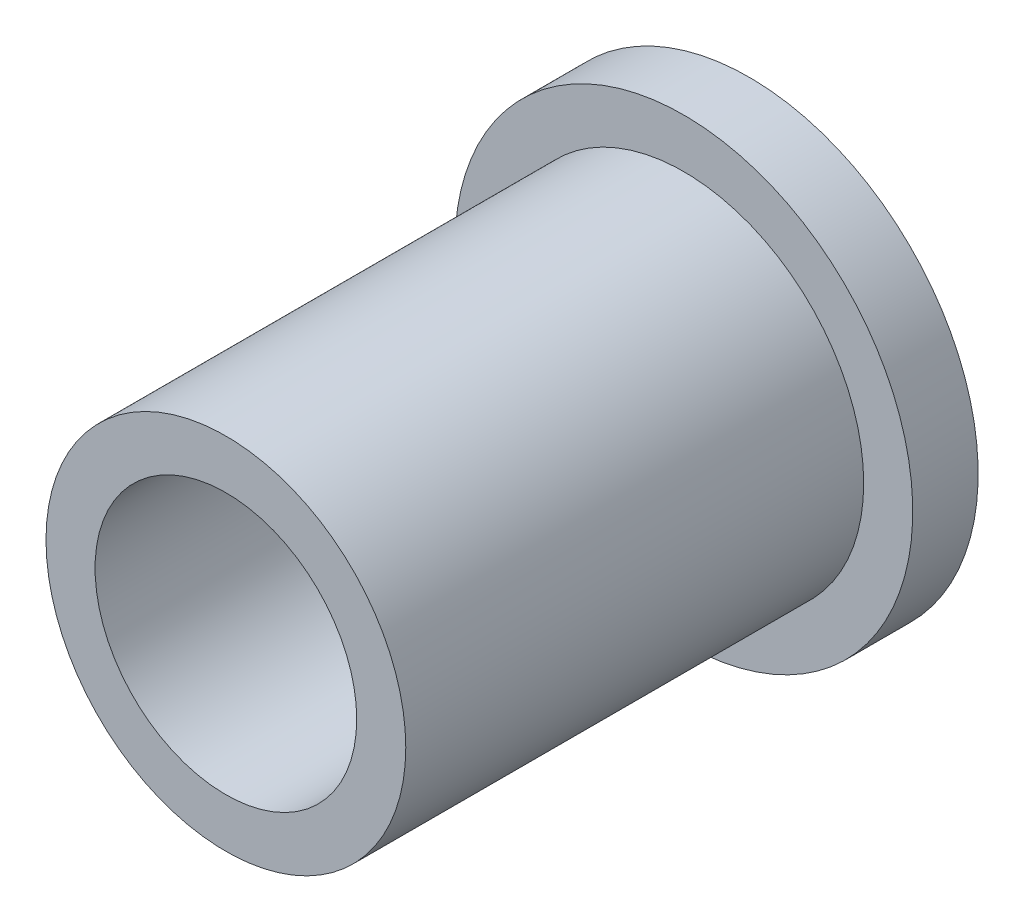
ISO-10303-21;
HEADER;
FILE_DESCRIPTION(('STEP AP214'),'2;1');
FILE_NAME('part.step','',(''),(''),'','','');
FILE_SCHEMA(('AUTOMOTIVE_DESIGN { 1 0 10303 214 1 1 1 1 }'));
ENDSEC;
DATA;
#1=APPLICATION_CONTEXT('core data for automotive mechanical design processes');
#2=APPLICATION_PROTOCOL_DEFINITION('international standard','automotive_design',2000,#1);
#3=PRODUCT_CONTEXT('',#1,'mechanical');
#4=PRODUCT('Part','Part','',(#3));
#5=PRODUCT_RELATED_PRODUCT_CATEGORY('part','',(#4));
#6=PRODUCT_DEFINITION_FORMATION('','',#4);
#7=PRODUCT_DEFINITION_CONTEXT('part definition',#1,'design');
#8=PRODUCT_DEFINITION('design','',#6,#7);
#9=PRODUCT_DEFINITION_SHAPE('','',#8);
#10=(LENGTH_UNIT() NAMED_UNIT(*) SI_UNIT(.MILLI.,.METRE.));
#11=(NAMED_UNIT(*) PLANE_ANGLE_UNIT() SI_UNIT($,.RADIAN.));
#12=(NAMED_UNIT(*) SI_UNIT($,.STERADIAN.) SOLID_ANGLE_UNIT());
#13=UNCERTAINTY_MEASURE_WITH_UNIT(LENGTH_MEASURE(1.E-05),#10,'distance_accuracy_value','');
#14=(GEOMETRIC_REPRESENTATION_CONTEXT(3) GLOBAL_UNCERTAINTY_ASSIGNED_CONTEXT((#13)) GLOBAL_UNIT_ASSIGNED_CONTEXT((#10,
#11,#12)) REPRESENTATION_CONTEXT('',''));
#15=CARTESIAN_POINT('',(0.,0.,0.));
#16=DIRECTION('',(0.,0.,1.));
#17=DIRECTION('',(1.,0.,0.));
#18=AXIS2_PLACEMENT_3D('',#15,#16,#17);
#19=CARTESIAN_POINT('',(0.,0.,8.));
#20=DIRECTION('',(0.,0.,-1.));
#21=DIRECTION('',(-1.,0.,0.));
#22=AXIS2_PLACEMENT_3D('',#19,#20,#21);
#23=CYLINDRICAL_SURFACE('',#22,2.75);
#24=CARTESIAN_POINT('',(0.,0.,8.));
#25=DIRECTION('',(0.,0.,1.));
#26=DIRECTION('',(1.,0.,0.));
#27=AXIS2_PLACEMENT_3D('',#24,#25,#26);
#28=CIRCLE('',#27,2.75);
#29=CARTESIAN_POINT('',(2.75,0.,8.));
#30=VERTEX_POINT('',#29);
#31=EDGE_CURVE('E49',#30,#30,#28,.T.);
#32=ORIENTED_EDGE('',*,*,#31,.F.);
#33=EDGE_LOOP('',(#32));
#34=FACE_BOUND('',#33,.T.);
#35=CARTESIAN_POINT('',(0.,0.,1.));
#36=DIRECTION('',(0.,0.,-1.));
#37=DIRECTION('',(-1.,0.,0.));
#38=AXIS2_PLACEMENT_3D('',#35,#36,#37);
#39=CIRCLE('',#38,2.75);
#40=CARTESIAN_POINT('',(-2.75,0.,1.));
#41=VERTEX_POINT('',#40);
#42=EDGE_CURVE('E10',#41,#41,#39,.T.);
#43=ORIENTED_EDGE('',*,*,#42,.F.);
#44=EDGE_LOOP('',(#43));
#45=FACE_BOUND('',#44,.T.);
#46=ADVANCED_FACE('F43',(#34,#45),#23,.T.);
#47=CARTESIAN_POINT('',(0.,0.,8.));
#48=DIRECTION('',(0.,0.,1.));
#49=DIRECTION('',(1.,0.,0.));
#50=AXIS2_PLACEMENT_3D('',#47,#48,#49);
#51=PLANE('',#50);
#52=ORIENTED_EDGE('',*,*,#31,.T.);
#53=EDGE_LOOP('',(#52));
#54=FACE_BOUND('',#53,.T.);
#55=CARTESIAN_POINT('',(0.,0.,8.));
#56=DIRECTION('',(0.,0.,1.));
#57=DIRECTION('',(1.,0.,0.));
#58=AXIS2_PLACEMENT_3D('',#55,#56,#57);
#59=CIRCLE('',#58,2.);
#60=CARTESIAN_POINT('',(2.,0.,8.));
#61=VERTEX_POINT('',#60);
#62=EDGE_CURVE('E53',#61,#61,#59,.T.);
#63=ORIENTED_EDGE('',*,*,#62,.F.);
#64=EDGE_LOOP('',(#63));
#65=FACE_BOUND('',#64,.T.);
#66=ADVANCED_FACE('F81',(#54,#65),#51,.T.);
#67=CARTESIAN_POINT('',(0.,0.,0.));
#68=DIRECTION('',(0.,0.,1.));
#69=DIRECTION('',(1.,0.,0.));
#70=AXIS2_PLACEMENT_3D('',#67,#68,#69);
#71=PLANE('',#70);
#72=CARTESIAN_POINT('',(0.,0.,0.));
#73=DIRECTION('',(0.,0.,1.));
#74=DIRECTION('',(1.,0.,0.));
#75=AXIS2_PLACEMENT_3D('',#72,#73,#74);
#76=CIRCLE('',#75,2.);
#77=CARTESIAN_POINT('',(2.,0.,0.));
#78=VERTEX_POINT('',#77);
#79=EDGE_CURVE('E57',#78,#78,#76,.T.);
#80=ORIENTED_EDGE('',*,*,#79,.T.);
#81=EDGE_LOOP('',(#80));
#82=FACE_BOUND('',#81,.T.);
#83=CARTESIAN_POINT('',(0.,0.,0.));
#84=DIRECTION('',(0.,0.,-1.));
#85=DIRECTION('',(-1.,0.,0.));
#86=AXIS2_PLACEMENT_3D('',#83,#84,#85);
#87=CIRCLE('',#86,3.5);
#88=CARTESIAN_POINT('',(-3.5,0.,0.));
#89=VERTEX_POINT('',#88);
#90=EDGE_CURVE('E63',#89,#89,#87,.T.);
#91=ORIENTED_EDGE('',*,*,#90,.T.);
#92=EDGE_LOOP('',(#91));
#93=FACE_BOUND('',#92,.T.);
#94=ADVANCED_FACE('F86',(#82,#93),#71,.F.);
#95=CARTESIAN_POINT('',(0.,0.,8.));
#96=DIRECTION('',(0.,0.,-1.));
#97=DIRECTION('',(-1.,0.,0.));
#98=AXIS2_PLACEMENT_3D('',#95,#96,#97);
#99=CYLINDRICAL_SURFACE('',#98,2.);
#100=ORIENTED_EDGE('',*,*,#62,.T.);
#101=EDGE_LOOP('',(#100));
#102=FACE_BOUND('',#101,.T.);
#103=ORIENTED_EDGE('',*,*,#79,.F.);
#104=EDGE_LOOP('',(#103));
#105=FACE_BOUND('',#104,.T.);
#106=ADVANCED_FACE('F78',(#102,#105),#99,.F.);
#107=CARTESIAN_POINT('',(0.,0.,1.));
#108=DIRECTION('',(0.,0.,-1.));
#109=DIRECTION('',(-1.,0.,0.));
#110=AXIS2_PLACEMENT_3D('',#107,#108,#109);
#111=CYLINDRICAL_SURFACE('',#110,3.5);
#112=CARTESIAN_POINT('',(0.,0.,1.));
#113=DIRECTION('',(0.,0.,-1.));
#114=DIRECTION('',(-1.,0.,0.));
#115=AXIS2_PLACEMENT_3D('',#112,#113,#114);
#116=CIRCLE('',#115,3.5);
#117=CARTESIAN_POINT('',(-3.5,0.,1.));
#118=VERTEX_POINT('',#117);
#119=EDGE_CURVE('E61',#118,#118,#116,.T.);
#120=ORIENTED_EDGE('',*,*,#119,.T.);
#121=EDGE_LOOP('',(#120));
#122=FACE_BOUND('',#121,.T.);
#123=ORIENTED_EDGE('',*,*,#90,.F.);
#124=EDGE_LOOP('',(#123));
#125=FACE_BOUND('',#124,.T.);
#126=ADVANCED_FACE('F69',(#122,#125),#111,.T.);
#127=CARTESIAN_POINT('',(0.,0.,1.));
#128=DIRECTION('',(0.,0.,-1.));
#129=DIRECTION('',(-1.,0.,0.));
#130=AXIS2_PLACEMENT_3D('',#127,#128,#129);
#131=PLANE('',#130);
#132=ORIENTED_EDGE('',*,*,#42,.T.);
#133=EDGE_LOOP('',(#132));
#134=FACE_BOUND('',#133,.T.);
#135=ORIENTED_EDGE('',*,*,#119,.F.);
#136=EDGE_LOOP('',(#135));
#137=FACE_BOUND('',#136,.T.);
#138=ADVANCED_FACE('F72',(#134,#137),#131,.F.);
#139=CLOSED_SHELL('',(#46,#66,#94,#106,#126,#138));
#140=MANIFOLD_SOLID_BREP('B2',#139);
#141=ADVANCED_BREP_SHAPE_REPRESENTATION('',(#18,#140),#14);
#142=SHAPE_DEFINITION_REPRESENTATION(#9,#141);
ENDSEC;
END-ISO-10303-21;
